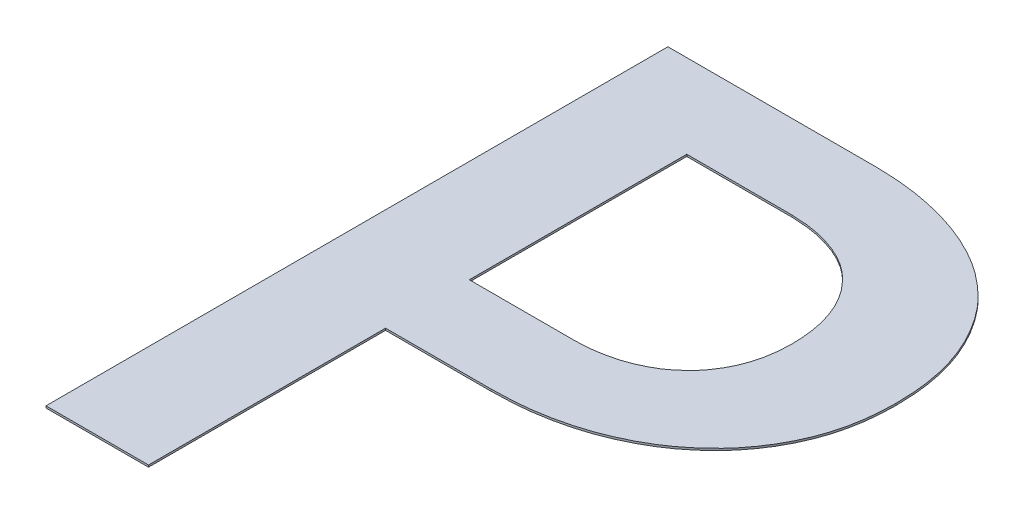
ISO-10303-21;
HEADER;
FILE_DESCRIPTION(('STEP AP214'),'2;1');
FILE_NAME('part.step','',(''),(''),'','','');
FILE_SCHEMA(('AUTOMOTIVE_DESIGN { 1 0 10303 214 1 1 1 1 }'));
ENDSEC;
DATA;
#1=APPLICATION_CONTEXT('core data for automotive mechanical design processes');
#2=APPLICATION_PROTOCOL_DEFINITION('international standard','automotive_design',2000,#1);
#3=PRODUCT_CONTEXT('',#1,'mechanical');
#4=PRODUCT('Part','Part','',(#3));
#5=PRODUCT_RELATED_PRODUCT_CATEGORY('part','',(#4));
#6=PRODUCT_DEFINITION_FORMATION('','',#4);
#7=PRODUCT_DEFINITION_CONTEXT('part definition',#1,'design');
#8=PRODUCT_DEFINITION('design','',#6,#7);
#9=PRODUCT_DEFINITION_SHAPE('','',#8);
#10=(LENGTH_UNIT() NAMED_UNIT(*) SI_UNIT(.MILLI.,.METRE.));
#11=(NAMED_UNIT(*) PLANE_ANGLE_UNIT() SI_UNIT($,.RADIAN.));
#12=(NAMED_UNIT(*) SI_UNIT($,.STERADIAN.) SOLID_ANGLE_UNIT());
#13=UNCERTAINTY_MEASURE_WITH_UNIT(LENGTH_MEASURE(1.E-05),#10,'distance_accuracy_value','');
#14=(GEOMETRIC_REPRESENTATION_CONTEXT(3) GLOBAL_UNCERTAINTY_ASSIGNED_CONTEXT((#13)) GLOBAL_UNIT_ASSIGNED_CONTEXT((#10,
#11,#12)) REPRESENTATION_CONTEXT('',''));
#15=CARTESIAN_POINT('',(0.,0.,0.));
#16=DIRECTION('',(0.,0.,1.));
#17=DIRECTION('',(1.,0.,0.));
#18=AXIS2_PLACEMENT_3D('',#15,#16,#17);
#19=CARTESIAN_POINT('',(-10.95038620204,6.01,2.396145284792));
#20=DIRECTION('',(-1.,0.,0.));
#21=DIRECTION('',(0.,0.,1.));
#22=AXIS2_PLACEMENT_3D('',#19,#20,#21);
#23=PLANE('',#22);
#24=DIRECTION('',(0.,0.,-1.));
#25=VECTOR('',#24,1.);
#26=CARTESIAN_POINT('',(-10.95038620204,6.,2.396145284792));
#27=LINE('',#26,#25);
#28=CARTESIAN_POINT('',(-10.95038620204,6.,2.396145284792));
#29=VERTEX_POINT('',#28);
#30=CARTESIAN_POINT('',(-10.95038620204,6.,1.286122899769));
#31=VERTEX_POINT('',#30);
#32=EDGE_CURVE('E180',#29,#31,#27,.T.);
#33=ORIENTED_EDGE('',*,*,#32,.T.);
#34=DIRECTION('',(0.,-1.,0.));
#35=VECTOR('',#34,1.);
#36=CARTESIAN_POINT('',(-10.95038620204,6.01,1.286122899769));
#37=LINE('',#36,#35);
#38=CARTESIAN_POINT('',(-10.95038620204,6.009999999998,1.286122899769));
#39=VERTEX_POINT('',#38);
#40=EDGE_CURVE('E11',#39,#31,#37,.T.);
#41=ORIENTED_EDGE('',*,*,#40,.F.);
#42=DIRECTION('',(0.,0.,-1.));
#43=VECTOR('',#42,1.);
#44=CARTESIAN_POINT('',(-10.95038620204,6.01,2.396145284792));
#45=LINE('',#44,#43);
#46=CARTESIAN_POINT('',(-10.95038620204,6.01,2.396145284792));
#47=VERTEX_POINT('',#46);
#48=EDGE_CURVE('E202',#47,#39,#45,.T.);
#49=ORIENTED_EDGE('',*,*,#48,.F.);
#50=DIRECTION('',(0.,-1.,0.));
#51=VECTOR('',#50,1.);
#52=CARTESIAN_POINT('',(-10.95038620204,6.01,2.396145284792));
#53=LINE('',#52,#51);
#54=EDGE_CURVE('E182',#47,#29,#53,.T.);
#55=ORIENTED_EDGE('',*,*,#54,.T.);
#56=EDGE_LOOP('',(#33,#41,#49,#55));
#57=FACE_BOUND('',#56,.T.);
#58=ADVANCED_FACE('F16',(#57),#23,.F.);
#59=CARTESIAN_POINT('',(-10.95038620204,6.01,1.286122899769));
#60=DIRECTION('',(0.,0.,-1.));
#61=DIRECTION('',(0.,-1.,0.));
#62=AXIS2_PLACEMENT_3D('',#59,#60,#61);
#63=PLANE('',#62);
#64=DIRECTION('',(1.,0.,0.));
#65=VECTOR('',#64,1.);
#66=CARTESIAN_POINT('',(-10.95038620204,6.,1.286122899769));
#67=LINE('',#66,#65);
#68=CARTESIAN_POINT('',(-10.41217395133,6.,1.286122899769));
#69=VERTEX_POINT('',#68);
#70=EDGE_CURVE('E183',#31,#69,#67,.T.);
#71=ORIENTED_EDGE('',*,*,#70,.T.);
#72=DIRECTION('',(0.,-1.,0.));
#73=VECTOR('',#72,1.);
#74=CARTESIAN_POINT('',(-10.41217395133,6.01,1.286122899769));
#75=LINE('',#74,#73);
#76=CARTESIAN_POINT('',(-10.41217395133,6.01,1.286122899769));
#77=VERTEX_POINT('',#76);
#78=EDGE_CURVE('E30',#77,#69,#75,.T.);
#79=ORIENTED_EDGE('',*,*,#78,.F.);
#80=DIRECTION('',(1.,0.,0.));
#81=VECTOR('',#80,1.);
#82=CARTESIAN_POINT('',(-10.95038620204,6.01,1.286122899769));
#83=LINE('',#82,#81);
#84=EDGE_CURVE('E206',#39,#77,#83,.T.);
#85=ORIENTED_EDGE('',*,*,#84,.F.);
#86=ORIENTED_EDGE('',*,*,#40,.T.);
#87=EDGE_LOOP('',(#71,#79,#85,#86));
#88=FACE_BOUND('',#87,.T.);
#89=ADVANCED_FACE('F457',(#88),#63,.F.);
#90=CARTESIAN_POINT('',(-10.41217395133,6.01,1.286122899769));
#91=CARTESIAN_POINT('',(-10.39061564213,6.01,1.287104789912));
#92=CARTESIAN_POINT('',(-10.34820995169,6.01,1.289036190426));
#93=CARTESIAN_POINT('',(-10.28648622314,6.01,1.29713771831));
#94=CARTESIAN_POINT('',(-10.22822940628,6.01,1.311120204658));
#95=CARTESIAN_POINT('',(-10.17339112048,6.01,1.328908676561));
#96=CARTESIAN_POINT('',(-10.12205805977,6.01,1.35161240023));
#97=CARTESIAN_POINT('',(-10.07472081233,6.01,1.378702792173));
#98=CARTESIAN_POINT('',(-10.03146035385,6.01,1.410518972583));
#99=CARTESIAN_POINT('',(-10.00614197228,6.01,1.435280204639));
#100=CARTESIAN_POINT('',(-9.993492632653,6.01,1.447651186297));
#101=(BOUNDED_CURVE() B_SPLINE_CURVE(3,(#90,#91,#92,#93,#94,#95,#96,#97,#98,#99,#100),
.UNSPECIFIED.,.F.,.F.) B_SPLINE_CURVE_WITH_KNOTS((4,1,1,1,1,1,1,1,4),(0.,0.14052574786,
0.276417380806,0.404689024683,0.530223995438,0.651428726346,0.769566983292,0.88487315103,1.),
.UNSPECIFIED.) CURVE() GEOMETRIC_REPRESENTATION_ITEM() RATIONAL_B_SPLINE_CURVE((1.,1.,1.,1.,1.,
1.,1.,1.,1.,1.,1.)) REPRESENTATION_ITEM(''));
#102=DIRECTION('',(0.,-1.,0.));
#103=VECTOR('',#102,1.);
#104=SURFACE_OF_LINEAR_EXTRUSION('',#101,#103);
#105=CARTESIAN_POINT('',(-10.41217395133,6.,1.286122899769));
#106=CARTESIAN_POINT('',(-10.39061564213,6.,1.287104789912));
#107=CARTESIAN_POINT('',(-10.34820995169,6.,1.289036190426));
#108=CARTESIAN_POINT('',(-10.28648622314,6.,1.29713771831));
#109=CARTESIAN_POINT('',(-10.22822940628,6.,1.311120204658));
#110=CARTESIAN_POINT('',(-10.17339112048,6.,1.328908676561));
#111=CARTESIAN_POINT('',(-10.12205805977,6.,1.35161240023));
#112=CARTESIAN_POINT('',(-10.07472081233,6.,1.378702792173));
#113=CARTESIAN_POINT('',(-10.03146035385,6.,1.410518972583));
#114=CARTESIAN_POINT('',(-10.00614197228,6.,1.435280204639));
#115=CARTESIAN_POINT('',(-9.993492632653,6.,1.447651186297));
#116=B_SPLINE_CURVE_WITH_KNOTS('',3,(#105,#106,#107,#108,#109,#110,#111,#112,#113,#114,#115),
.UNSPECIFIED.,.F.,.F.,(4,1,1,1,1,1,1,1,4),(0.,0.14052574786,0.276417380806,0.404689024683,
0.530223995438,0.651428726346,0.769566983292,0.88487315103,1.),.UNSPECIFIED.);
#117=CARTESIAN_POINT('',(-9.993492632653,6.,1.447651186297));
#118=VERTEX_POINT('',#117);
#119=EDGE_CURVE('E192',#69,#118,#116,.T.);
#120=ORIENTED_EDGE('',*,*,#119,.T.);
#121=DIRECTION('',(0.,-1.,0.));
#122=VECTOR('',#121,1.);
#123=CARTESIAN_POINT('',(-9.993492632653,6.01,1.447651186297));
#124=LINE('',#123,#122);
#125=CARTESIAN_POINT('',(-9.993492632653,6.01,1.447651186297));
#126=VERTEX_POINT('',#125);
#127=EDGE_CURVE('E196',#126,#118,#124,.T.);
#128=ORIENTED_EDGE('',*,*,#127,.F.);
#129=CARTESIAN_POINT('',(-10.41217395133,6.01,1.286122899769));
#130=CARTESIAN_POINT('',(-10.39061564213,6.01,1.287104789912));
#131=CARTESIAN_POINT('',(-10.34820995169,6.01,1.289036190426));
#132=CARTESIAN_POINT('',(-10.28648622314,6.01,1.29713771831));
#133=CARTESIAN_POINT('',(-10.22822940628,6.01,1.311120204658));
#134=CARTESIAN_POINT('',(-10.17339112048,6.01,1.328908676561));
#135=CARTESIAN_POINT('',(-10.12205805977,6.01,1.35161240023));
#136=CARTESIAN_POINT('',(-10.07472081233,6.01,1.378702792173));
#137=CARTESIAN_POINT('',(-10.03146035385,6.01,1.410518972583));
#138=CARTESIAN_POINT('',(-10.00614197228,6.01,1.435280204639));
#139=CARTESIAN_POINT('',(-9.993492632653,6.01,1.447651186297));
#140=B_SPLINE_CURVE_WITH_KNOTS('',3,(#129,#130,#131,#132,#133,#134,#135,#136,#137,#138,#139),
.UNSPECIFIED.,.F.,.F.,(4,1,1,1,1,1,1,1,4),(0.,0.14052574786,0.276417380806,0.404689024683,
0.530223995438,0.651428726346,0.769566983292,0.88487315103,1.),.UNSPECIFIED.);
#141=EDGE_CURVE('E211',#77,#126,#140,.T.);
#142=ORIENTED_EDGE('',*,*,#141,.F.);
#143=ORIENTED_EDGE('',*,*,#78,.T.);
#144=EDGE_LOOP('',(#120,#128,#142,#143));
#145=FACE_BOUND('',#144,.T.);
#146=ADVANCED_FACE('F456',(#145),#104,.F.);
#147=CARTESIAN_POINT('',(-9.993492632653,6.01,1.447651186297));
#148=CARTESIAN_POINT('',(-9.981556535716,6.01,1.460754279016));
#149=CARTESIAN_POINT('',(-9.957739204466,6.01,1.486900237893));
#150=CARTESIAN_POINT('',(-9.927455859616,6.01,1.530656389083));
#151=CARTESIAN_POINT('',(-9.90123124537,6.01,1.577514720148));
#152=CARTESIAN_POINT('',(-9.880262873755,6.01,1.627924850447));
#153=CARTESIAN_POINT('',(-9.86305676779,6.01,1.681211322786));
#154=CARTESIAN_POINT('',(-9.851852823006,6.01,1.737600650919));
#155=CARTESIAN_POINT('',(-9.844455119814,6.01,1.796787745854));
#156=CARTESIAN_POINT('',(-9.843458376492,6.01,1.837233808429));
#157=CARTESIAN_POINT('',(-9.842948269608,6.01,1.857933034079));
#158=(BOUNDED_CURVE() B_SPLINE_CURVE(3,(#147,#148,#149,#150,#151,#152,#153,#154,#155,#156,#157),
.UNSPECIFIED.,.F.,.F.) B_SPLINE_CURVE_WITH_KNOTS((4,1,1,1,1,1,1,1,4),(0.,0.118517492591,
0.236490235872,0.355217928142,0.477302145162,0.601303082104,0.729367994928,0.861497693858,1.),
.UNSPECIFIED.) CURVE() GEOMETRIC_REPRESENTATION_ITEM() RATIONAL_B_SPLINE_CURVE((1.,1.,1.,1.,1.,
1.,1.,1.,1.,1.,1.)) REPRESENTATION_ITEM(''));
#159=DIRECTION('',(0.,-1.,0.));
#160=VECTOR('',#159,1.);
#161=SURFACE_OF_LINEAR_EXTRUSION('',#158,#160);
#162=CARTESIAN_POINT('',(-9.993492632653,6.,1.447651186297));
#163=CARTESIAN_POINT('',(-9.981556535716,6.,1.460754279016));
#164=CARTESIAN_POINT('',(-9.957739204466,6.,1.486900237893));
#165=CARTESIAN_POINT('',(-9.927455859616,6.,1.530656389083));
#166=CARTESIAN_POINT('',(-9.90123124537,6.,1.577514720148));
#167=CARTESIAN_POINT('',(-9.880262873755,6.,1.627924850447));
#168=CARTESIAN_POINT('',(-9.86305676779,6.,1.681211322786));
#169=CARTESIAN_POINT('',(-9.851852823006,6.,1.737600650919));
#170=CARTESIAN_POINT('',(-9.844455119814,6.,1.796787745854));
#171=CARTESIAN_POINT('',(-9.843458376492,6.,1.837233808429));
#172=CARTESIAN_POINT('',(-9.842948269608,6.,1.857933034079));
#173=B_SPLINE_CURVE_WITH_KNOTS('',3,(#162,#163,#164,#165,#166,#167,#168,#169,#170,#171,#172),
.UNSPECIFIED.,.F.,.F.,(4,1,1,1,1,1,1,1,4),(0.,0.118517492591,0.236490235872,0.355217928142,
0.477302145162,0.601303082104,0.729367994928,0.861497693858,1.),.UNSPECIFIED.);
#174=CARTESIAN_POINT('',(-9.842948269608,6.,1.857933034079));
#175=VERTEX_POINT('',#174);
#176=EDGE_CURVE('E285',#118,#175,#173,.T.);
#177=ORIENTED_EDGE('',*,*,#176,.T.);
#178=DIRECTION('',(0.,-1.,0.));
#179=VECTOR('',#178,1.);
#180=CARTESIAN_POINT('',(-9.842948269608,6.01,1.857933034079));
#181=LINE('',#180,#179);
#182=CARTESIAN_POINT('',(-9.842948269608,6.01,1.857933034079));
#183=VERTEX_POINT('',#182);
#184=EDGE_CURVE('E193',#183,#175,#181,.T.);
#185=ORIENTED_EDGE('',*,*,#184,.F.);
#186=CARTESIAN_POINT('',(-9.993492632653,6.01,1.447651186297));
#187=CARTESIAN_POINT('',(-9.981556535716,6.01,1.460754279016));
#188=CARTESIAN_POINT('',(-9.957739204466,6.01,1.486900237893));
#189=CARTESIAN_POINT('',(-9.927455859616,6.01,1.530656389083));
#190=CARTESIAN_POINT('',(-9.90123124537,6.01,1.577514720148));
#191=CARTESIAN_POINT('',(-9.880262873755,6.01,1.627924850447));
#192=CARTESIAN_POINT('',(-9.86305676779,6.01,1.681211322786));
#193=CARTESIAN_POINT('',(-9.851852823006,6.01,1.737600650919));
#194=CARTESIAN_POINT('',(-9.844455119814,6.01,1.796787745854));
#195=CARTESIAN_POINT('',(-9.843458376492,6.01,1.837233808429));
#196=CARTESIAN_POINT('',(-9.842948269608,6.01,1.857933034079));
#197=B_SPLINE_CURVE_WITH_KNOTS('',3,(#186,#187,#188,#189,#190,#191,#192,#193,#194,#195,#196),
.UNSPECIFIED.,.F.,.F.,(4,1,1,1,1,1,1,1,4),(0.,0.118517492591,0.236490235872,0.355217928142,
0.477302145162,0.601303082104,0.729367994928,0.861497693858,1.),.UNSPECIFIED.);
#198=EDGE_CURVE('E319',#126,#183,#197,.T.);
#199=ORIENTED_EDGE('',*,*,#198,.F.);
#200=ORIENTED_EDGE('',*,*,#127,.T.);
#201=EDGE_LOOP('',(#177,#185,#199,#200));
#202=FACE_BOUND('',#201,.T.);
#203=ADVANCED_FACE('F451',(#202),#161,.F.);
#204=CARTESIAN_POINT('',(-9.842948269608,6.01,1.857933034079));
#205=CARTESIAN_POINT('',(-9.843464652479,6.01,1.876910310168));
#206=CARTESIAN_POINT('',(-9.844477641894,6.01,1.914138074545));
#207=CARTESIAN_POINT('',(-9.851874196864,6.01,1.968820429887));
#208=CARTESIAN_POINT('',(-9.863278486037,6.01,2.021498983627));
#209=CARTESIAN_POINT('',(-9.880105266203,6.01,2.071683533863));
#210=CARTESIAN_POINT('',(-9.901397061999,6.01,2.119190306131));
#211=CARTESIAN_POINT('',(-9.92767311889,6.01,2.163379305529));
#212=CARTESIAN_POINT('',(-9.957590282255,6.01,2.205075645955));
#213=CARTESIAN_POINT('',(-9.981533109567,6.01,2.229516135712));
#214=CARTESIAN_POINT('',(-9.993492632653,6.01,2.241724242871));
#215=(BOUNDED_CURVE() B_SPLINE_CURVE(3,(#204,#205,#206,#207,#208,#209,#210,#211,#212,#213,#214),
.UNSPECIFIED.,.F.,.F.) B_SPLINE_CURVE_WITH_KNOTS((4,1,1,1,1,1,1,1,4),(0.,0.134354815369,
0.263564137766,0.390117692403,0.515517169,0.63770338976,0.758028749237,0.879134543217,1.),
.UNSPECIFIED.) CURVE() GEOMETRIC_REPRESENTATION_ITEM() RATIONAL_B_SPLINE_CURVE((1.,1.,1.,1.,1.,
1.,1.,1.,1.,1.,1.)) REPRESENTATION_ITEM(''));
#216=DIRECTION('',(0.,-1.,0.));
#217=VECTOR('',#216,1.);
#218=SURFACE_OF_LINEAR_EXTRUSION('',#215,#217);
#219=CARTESIAN_POINT('',(-9.842948269608,6.,1.857933034079));
#220=CARTESIAN_POINT('',(-9.843464652479,6.,1.876910310168));
#221=CARTESIAN_POINT('',(-9.844477641894,6.,1.914138074545));
#222=CARTESIAN_POINT('',(-9.851874196864,6.,1.968820429887));
#223=CARTESIAN_POINT('',(-9.863278486037,6.,2.021498983627));
#224=CARTESIAN_POINT('',(-9.880105266203,6.,2.071683533863));
#225=CARTESIAN_POINT('',(-9.901397061999,6.,2.119190306131));
#226=CARTESIAN_POINT('',(-9.92767311889,6.,2.163379305529));
#227=CARTESIAN_POINT('',(-9.957590282255,6.,2.205075645955));
#228=CARTESIAN_POINT('',(-9.981533109567,6.,2.229516135712));
#229=CARTESIAN_POINT('',(-9.993492632653,6.,2.241724242871));
#230=B_SPLINE_CURVE_WITH_KNOTS('',3,(#219,#220,#221,#222,#223,#224,#225,#226,#227,#228,#229),
.UNSPECIFIED.,.F.,.F.,(4,1,1,1,1,1,1,1,4),(0.,0.134354815369,0.263564137766,0.390117692403,
0.515517169,0.63770338976,0.758028749237,0.879134543217,1.),.UNSPECIFIED.);
#231=CARTESIAN_POINT('',(-9.993492632653,6.,2.241724242871));
#232=VERTEX_POINT('',#231);
#233=EDGE_CURVE('E294',#175,#232,#230,.T.);
#234=ORIENTED_EDGE('',*,*,#233,.T.);
#235=DIRECTION('',(0.,-1.,0.));
#236=VECTOR('',#235,1.);
#237=CARTESIAN_POINT('',(-9.993492632653,6.01,2.241724242871));
#238=LINE('',#237,#236);
#239=CARTESIAN_POINT('',(-9.993492632653,6.01,2.241724242871));
#240=VERTEX_POINT('',#239);
#241=EDGE_CURVE('E197',#240,#232,#238,.T.);
#242=ORIENTED_EDGE('',*,*,#241,.F.);
#243=CARTESIAN_POINT('',(-9.842948269608,6.01,1.857933034079));
#244=CARTESIAN_POINT('',(-9.843464652479,6.01,1.876910310168));
#245=CARTESIAN_POINT('',(-9.844477641894,6.01,1.914138074545));
#246=CARTESIAN_POINT('',(-9.851874196864,6.01,1.968820429887));
#247=CARTESIAN_POINT('',(-9.863278486037,6.01,2.021498983627));
#248=CARTESIAN_POINT('',(-9.880105266203,6.01,2.071683533863));
#249=CARTESIAN_POINT('',(-9.901397061999,6.01,2.119190306131));
#250=CARTESIAN_POINT('',(-9.92767311889,6.01,2.163379305529));
#251=CARTESIAN_POINT('',(-9.957590282255,6.01,2.205075645955));
#252=CARTESIAN_POINT('',(-9.981533109567,6.01,2.229516135712));
#253=CARTESIAN_POINT('',(-9.993492632653,6.01,2.241724242871));
#254=B_SPLINE_CURVE_WITH_KNOTS('',3,(#243,#244,#245,#246,#247,#248,#249,#250,#251,#252,#253),
.UNSPECIFIED.,.F.,.F.,(4,1,1,1,1,1,1,1,4),(0.,0.134354815369,0.263564137766,0.390117692403,
0.515517169,0.63770338976,0.758028749237,0.879134543217,1.),.UNSPECIFIED.);
#255=EDGE_CURVE('E272',#183,#240,#254,.T.);
#256=ORIENTED_EDGE('',*,*,#255,.F.);
#257=ORIENTED_EDGE('',*,*,#184,.T.);
#258=EDGE_LOOP('',(#234,#242,#256,#257));
#259=FACE_BOUND('',#258,.T.);
#260=ADVANCED_FACE('F447',(#259),#218,.F.);
#261=CARTESIAN_POINT('',(-9.993492632653,6.01,2.241724242871));
#262=CARTESIAN_POINT('',(-10.00621375128,6.01,2.253160462077));
#263=CARTESIAN_POINT('',(-10.03191665949,6.01,2.276267242317));
#264=CARTESIAN_POINT('',(-10.07469808081,6.01,2.3069564853));
#265=CARTESIAN_POINT('',(-10.1224348403,6.01,2.332331882933));
#266=CARTESIAN_POINT('',(-10.17322827444,6.01,2.355507517809));
#267=CARTESIAN_POINT('',(-10.22828076931,6.01,2.372427606159));
#268=CARTESIAN_POINT('',(-10.28656708435,6.01,2.38557406771));
#269=CARTESIAN_POINT('',(-10.34818087792,6.01,2.39408812186));
#270=CARTESIAN_POINT('',(-10.39060969803,6.01,2.395452066289));
#271=CARTESIAN_POINT('',(-10.41217395133,6.01,2.396145284792));
#272=(BOUNDED_CURVE() B_SPLINE_CURVE(3,(#261,#262,#263,#264,#265,#266,#267,#268,#269,#270,#271),
.UNSPECIFIED.,.F.,.F.) B_SPLINE_CURVE_WITH_KNOTS((4,1,1,1,1,1,1,1,4),(0.,0.112226925341,
0.22675351478,0.344412268321,0.466545248744,0.592606541323,0.721543292644,0.858475655118,1.),
.UNSPECIFIED.) CURVE() GEOMETRIC_REPRESENTATION_ITEM() RATIONAL_B_SPLINE_CURVE((1.,1.,1.,1.,1.,
1.,1.,1.,1.,1.,1.)) REPRESENTATION_ITEM(''));
#273=DIRECTION('',(0.,-1.,0.));
#274=VECTOR('',#273,1.);
#275=SURFACE_OF_LINEAR_EXTRUSION('',#272,#274);
#276=CARTESIAN_POINT('',(-9.993492632653,6.,2.241724242871));
#277=CARTESIAN_POINT('',(-10.00621375128,6.,2.253160462077));
#278=CARTESIAN_POINT('',(-10.03191665949,6.,2.276267242317));
#279=CARTESIAN_POINT('',(-10.07469808081,6.,2.3069564853));
#280=CARTESIAN_POINT('',(-10.1224348403,6.,2.332331882933));
#281=CARTESIAN_POINT('',(-10.17322827444,6.,2.355507517809));
#282=CARTESIAN_POINT('',(-10.22828076931,6.,2.372427606159));
#283=CARTESIAN_POINT('',(-10.28656708435,6.,2.38557406771));
#284=CARTESIAN_POINT('',(-10.34818087792,6.,2.39408812186));
#285=CARTESIAN_POINT('',(-10.39060969803,6.,2.395452066289));
#286=CARTESIAN_POINT('',(-10.41217395133,6.,2.396145284792));
#287=B_SPLINE_CURVE_WITH_KNOTS('',3,(#276,#277,#278,#279,#280,#281,#282,#283,#284,#285,#286),
.UNSPECIFIED.,.F.,.F.,(4,1,1,1,1,1,1,1,4),(0.,0.112226925341,0.22675351478,0.344412268321,
0.466545248744,0.592606541323,0.721543292644,0.858475655118,1.),.UNSPECIFIED.);
#288=CARTESIAN_POINT('',(-10.41217395133,6.,2.396145284792));
#289=VERTEX_POINT('',#288);
#290=EDGE_CURVE('E271',#232,#289,#287,.T.);
#291=ORIENTED_EDGE('',*,*,#290,.T.);
#292=DIRECTION('',(0.,-1.,0.));
#293=VECTOR('',#292,1.);
#294=CARTESIAN_POINT('',(-10.41217395133,6.01,2.396145284792));
#295=LINE('',#294,#293);
#296=CARTESIAN_POINT('',(-10.41217395133,6.01,2.396145284792));
#297=VERTEX_POINT('',#296);
#298=EDGE_CURVE('E243',#297,#289,#295,.T.);
#299=ORIENTED_EDGE('',*,*,#298,.F.);
#300=CARTESIAN_POINT('',(-9.993492632653,6.01,2.241724242871));
#301=CARTESIAN_POINT('',(-10.00621375128,6.01,2.253160462077));
#302=CARTESIAN_POINT('',(-10.03191665949,6.01,2.276267242317));
#303=CARTESIAN_POINT('',(-10.07469808081,6.01,2.3069564853));
#304=CARTESIAN_POINT('',(-10.1224348403,6.01,2.332331882933));
#305=CARTESIAN_POINT('',(-10.17322827444,6.01,2.355507517809));
#306=CARTESIAN_POINT('',(-10.22828076931,6.01,2.372427606159));
#307=CARTESIAN_POINT('',(-10.28656708435,6.01,2.38557406771));
#308=CARTESIAN_POINT('',(-10.34818087792,6.01,2.39408812186));
#309=CARTESIAN_POINT('',(-10.39060969803,6.01,2.395452066289));
#310=CARTESIAN_POINT('',(-10.41217395133,6.01,2.396145284792));
#311=B_SPLINE_CURVE_WITH_KNOTS('',3,(#300,#301,#302,#303,#304,#305,#306,#307,#308,#309,#310),
.UNSPECIFIED.,.F.,.F.,(4,1,1,1,1,1,1,1,4),(0.,0.112226925341,0.22675351478,0.344412268321,
0.466545248744,0.592606541323,0.721543292644,0.858475655118,1.),.UNSPECIFIED.);
#312=EDGE_CURVE('E226',#240,#297,#311,.T.);
#313=ORIENTED_EDGE('',*,*,#312,.F.);
#314=ORIENTED_EDGE('',*,*,#241,.T.);
#315=EDGE_LOOP('',(#291,#299,#313,#314));
#316=FACE_BOUND('',#315,.T.);
#317=ADVANCED_FACE('F443',(#316),#275,.F.);
#318=CARTESIAN_POINT('',(-10.41217395133,6.01,2.396145284792));
#319=DIRECTION('',(0.,0.,1.));
#320=DIRECTION('',(1.,0.,0.));
#321=AXIS2_PLACEMENT_3D('',#318,#319,#320);
#322=PLANE('',#321);
#323=DIRECTION('',(-1.,0.,0.));
#324=VECTOR('',#323,1.);
#325=CARTESIAN_POINT('',(-10.41217395133,6.,2.396145284792));
#326=LINE('',#325,#324);
#327=EDGE_CURVE('E267',#289,#29,#326,.T.);
#328=ORIENTED_EDGE('',*,*,#327,.T.);
#329=ORIENTED_EDGE('',*,*,#54,.F.);
#330=DIRECTION('',(-1.,0.,0.));
#331=VECTOR('',#330,1.);
#332=CARTESIAN_POINT('',(-10.41217395133,6.01,2.396145284792));
#333=LINE('',#332,#331);
#334=EDGE_CURVE('E207',#297,#47,#333,.T.);
#335=ORIENTED_EDGE('',*,*,#334,.F.);
#336=ORIENTED_EDGE('',*,*,#298,.T.);
#337=EDGE_LOOP('',(#328,#329,#335,#336));
#338=FACE_BOUND('',#337,.T.);
#339=ADVANCED_FACE('F440',(#338),#322,.F.);
#340=CARTESIAN_POINT('',(-9.992396536457,6.,2.761462864758));
#341=DIRECTION('',(0.,-1.,1.150556770738E-12));
#342=DIRECTION('',(-1.,0.,0.));
#343=AXIS2_PLACEMENT_3D('',#340,#341,#342);
#344=PLANE('',#343);
#345=DIRECTION('',(0.,0.,-1.));
#346=VECTOR('',#345,1.);
#347=CARTESIAN_POINT('',(-10.95038620204,6.,4.034042110188));
#348=LINE('',#347,#346);
#349=CARTESIAN_POINT('',(-10.95038620204,6.,4.034042110188));
#350=VERTEX_POINT('',#349);
#351=CARTESIAN_POINT('',(-10.95038620204,6.,2.823872187518));
#352=VERTEX_POINT('',#351);
#353=EDGE_CURVE('E227',#350,#352,#348,.T.);
#354=ORIENTED_EDGE('',*,*,#353,.F.);
#355=DIRECTION('',(1.,0.,0.));
#356=VECTOR('',#355,1.);
#357=CARTESIAN_POINT('',(-11.47373785039,6.,4.034042110188));
#358=LINE('',#357,#356);
#359=CARTESIAN_POINT('',(-11.47373785039,6.,4.034042110188));
#360=VERTEX_POINT('',#359);
#361=EDGE_CURVE('E255',#360,#350,#358,.T.);
#362=ORIENTED_EDGE('',*,*,#361,.F.);
#363=DIRECTION('',(0.,0.,1.));
#364=VECTOR('',#363,1.);
#365=CARTESIAN_POINT('',(-11.47373785039,6.,0.859042110188));
#366=LINE('',#365,#364);
#367=CARTESIAN_POINT('',(-11.47373785039,6.,0.859042110188));
#368=VERTEX_POINT('',#367);
#369=EDGE_CURVE('E152',#368,#360,#366,.T.);
#370=ORIENTED_EDGE('',*,*,#369,.F.);
#371=DIRECTION('',(-1.,0.,0.));
#372=VECTOR('',#371,1.);
#373=CARTESIAN_POINT('',(-10.41217395133,6.,0.859042110188));
#374=LINE('',#373,#372);
#375=CARTESIAN_POINT('',(-10.41217395133,6.,0.859042110188));
#376=VERTEX_POINT('',#375);
#377=EDGE_CURVE('E166',#376,#368,#374,.T.);
#378=ORIENTED_EDGE('',*,*,#377,.F.);
#379=CARTESIAN_POINT('',(-9.622623686784,6.,1.129117405264));
#380=CARTESIAN_POINT('',(-9.647594592545,6.,1.10827741317));
#381=CARTESIAN_POINT('',(-9.697866112228,6.,1.066322264136));
#382=CARTESIAN_POINT('',(-9.782288001918,6.,1.013658851304));
#383=CARTESIAN_POINT('',(-9.873100108047,6.,0.967632930551));
#384=CARTESIAN_POINT('',(-9.970548300151,6.,0.928810187814));
#385=CARTESIAN_POINT('',(-10.07410767756,6.,0.898927659984));
#386=CARTESIAN_POINT('',(-10.18241654326,6.,0.875914684539));
#387=CARTESIAN_POINT('',(-10.29575102663,6.,0.862376103784));
#388=CARTESIAN_POINT('',(-10.37294132326,6.,0.86016561169));
#389=CARTESIAN_POINT('',(-10.41217395133,6.,0.859042110188));
#390=B_SPLINE_CURVE_WITH_KNOTS('',3,(#379,#380,#381,#382,#383,#384,#385,#386,#387,#388,#389),
.UNSPECIFIED.,.F.,.F.,(4,1,1,1,1,1,1,1,4),(0.,0.114377825174,0.230265859971,0.349276247655,
0.47246353563,0.598893027252,0.728255004333,0.86188328314,1.),.UNSPECIFIED.);
#391=CARTESIAN_POINT('',(-9.622623686784,6.,1.129117405264));
#392=VERTEX_POINT('',#391);
#393=EDGE_CURVE('E169',#392,#376,#390,.T.);
#394=ORIENTED_EDGE('',*,*,#393,.F.);
#395=CARTESIAN_POINT('',(-9.315073829234,6.,1.853410242057));
#396=CARTESIAN_POINT('',(-9.316063334944,6.,1.816099239356));
#397=CARTESIAN_POINT('',(-9.317993380004,6.,1.743323594185));
#398=CARTESIAN_POINT('',(-9.333168978138,6.,1.636985022001));
#399=CARTESIAN_POINT('',(-9.358109411667,6.,1.536348203298));
#400=CARTESIAN_POINT('',(-9.39403763413,6.,1.44165614319));
#401=CARTESIAN_POINT('',(-9.438534400139,6.,1.353128689395));
#402=CARTESIAN_POINT('',(-9.491336556029,6.,1.271054771559));
#403=CARTESIAN_POINT('',(-9.551883550485,6.,1.195248116225));
#404=CARTESIAN_POINT('',(-9.599011707294,6.,1.151190828819));
#405=CARTESIAN_POINT('',(-9.622623686784,6.,1.129117405264));
#406=B_SPLINE_CURVE_WITH_KNOTS('',3,(#395,#396,#397,#398,#399,#400,#401,#402,#403,#404,#405),
.UNSPECIFIED.,.F.,.F.,(4,1,1,1,1,1,1,1,4),(0.,0.137880567732,0.268938022214,0.396187076438,
0.520398722577,0.642523580873,0.761778280589,0.880647011602,1.),.UNSPECIFIED.);
#407=CARTESIAN_POINT('',(-9.315073829234,6.,1.853410242057));
#408=VERTEX_POINT('',#407);
#409=EDGE_CURVE('E259',#408,#392,#406,.T.);
#410=ORIENTED_EDGE('',*,*,#409,.F.);
#411=CARTESIAN_POINT('',(-9.622623686784,6.,2.555735231882));
#412=CARTESIAN_POINT('',(-9.59903722197,6.,2.534079080695));
#413=CARTESIAN_POINT('',(-9.552107743613,6.,2.490990305568));
#414=CARTESIAN_POINT('',(-9.491544618818,6.,2.417186670696));
#415=CARTESIAN_POINT('',(-9.438537605578,6.,2.337620175189));
#416=CARTESIAN_POINT('',(-9.394047709104,6.,2.25164969702));
#417=CARTESIAN_POINT('',(-9.358230133345,6.,2.159719527296));
#418=CARTESIAN_POINT('',(-9.333146669018,6.,2.062123071335));
#419=CARTESIAN_POINT('',(-9.318057172316,6.,1.95941407185));
#420=CARTESIAN_POINT('',(-9.31608146895,6.,1.889213589522));
#421=CARTESIAN_POINT('',(-9.315073829234,6.,1.853410242057));
#422=B_SPLINE_CURVE_WITH_KNOTS('',3,(#411,#412,#413,#414,#415,#416,#417,#418,#419,#420,#421),
.UNSPECIFIED.,.F.,.F.,(4,1,1,1,1,1,1,1,4),(0.,0.121249746887,0.241247996131,0.360801084557,
0.483123471511,0.607442836968,0.733972781045,0.864321944241,1.),.UNSPECIFIED.);
#423=CARTESIAN_POINT('',(-9.622623686784,6.,2.555735231882));
#424=VERTEX_POINT('',#423);
#425=EDGE_CURVE('E237',#424,#408,#422,.T.);
#426=ORIENTED_EDGE('',*,*,#425,.F.);
#427=CARTESIAN_POINT('',(-10.41217395133,6.,2.823872187518));
#428=CARTESIAN_POINT('',(-10.3729435425,6.,2.822967227611));
#429=CARTESIAN_POINT('',(-10.29577409215,6.,2.82118709682));
#430=CARTESIAN_POINT('',(-10.18245938669,6.,2.808236928736));
#431=CARTESIAN_POINT('',(-10.07402624774,6.,2.786088219203));
#432=CARTESIAN_POINT('',(-9.970558504019,6.,2.755997173899));
#433=CARTESIAN_POINT('',(-9.873097504457,6.,2.717231258948));
#434=CARTESIAN_POINT('',(-9.782288666327,6.,2.671190837804));
#435=CARTESIAN_POINT('',(-9.697865950467,6.,2.618531090755));
#436=CARTESIAN_POINT('',(-9.647594538861,6.,2.576575462176));
#437=CARTESIAN_POINT('',(-9.622623686784,6.,2.555735231882));
#438=B_SPLINE_CURVE_WITH_KNOTS('',3,(#427,#428,#429,#430,#431,#432,#433,#434,#435,#436,#437),
.UNSPECIFIED.,.F.,.F.,(4,1,1,1,1,1,1,1,4),(0.,0.138123182207,0.2716996934,0.400943544866,
0.52740753698,0.650628440703,0.76967130433,0.885590963032,1.),.UNSPECIFIED.);
#439=CARTESIAN_POINT('',(-10.41217395133,6.,2.823872187518));
#440=VERTEX_POINT('',#439);
#441=EDGE_CURVE('E21',#440,#424,#438,.T.);
#442=ORIENTED_EDGE('',*,*,#441,.F.);
#443=DIRECTION('',(1.,0.,0.));
#444=VECTOR('',#443,1.);
#445=CARTESIAN_POINT('',(-10.95038620204,6.,2.823872187518));
#446=LINE('',#445,#444);
#447=EDGE_CURVE('E184',#352,#440,#446,.T.);
#448=ORIENTED_EDGE('',*,*,#447,.F.);
#449=EDGE_LOOP('',(#354,#362,#370,#378,#394,#410,#426,#442,#448));
#450=FACE_BOUND('',#449,.T.);
#451=ORIENTED_EDGE('',*,*,#327,.F.);
#452=ORIENTED_EDGE('',*,*,#290,.F.);
#453=ORIENTED_EDGE('',*,*,#233,.F.);
#454=ORIENTED_EDGE('',*,*,#176,.F.);
#455=ORIENTED_EDGE('',*,*,#119,.F.);
#456=ORIENTED_EDGE('',*,*,#70,.F.);
#457=ORIENTED_EDGE('',*,*,#32,.F.);
#458=EDGE_LOOP('',(#451,#452,#453,#454,#455,#456,#457));
#459=FACE_BOUND('',#458,.T.);
#460=ADVANCED_FACE('F437',(#450,#459),#344,.T.);
#461=CARTESIAN_POINT('',(-9.992396536457,6.01,2.761462864758));
#462=DIRECTION('',(0.,-1.,1.150556770738E-12));
#463=DIRECTION('',(-1.,0.,0.));
#464=AXIS2_PLACEMENT_3D('',#461,#462,#463);
#465=PLANE('',#464);
#466=DIRECTION('',(0.,0.,-1.));
#467=VECTOR('',#466,1.);
#468=CARTESIAN_POINT('',(-10.95038620204,6.01,4.034042110188));
#469=LINE('',#468,#467);
#470=CARTESIAN_POINT('',(-10.95038620204,6.01,4.034042110188));
#471=VERTEX_POINT('',#470);
#472=CARTESIAN_POINT('',(-10.95038620204,6.01,2.823872187518));
#473=VERTEX_POINT('',#472);
#474=EDGE_CURVE('E215',#471,#473,#469,.T.);
#475=ORIENTED_EDGE('',*,*,#474,.T.);
#476=DIRECTION('',(1.,0.,0.));
#477=VECTOR('',#476,1.);
#478=CARTESIAN_POINT('',(-10.95038620204,6.01,2.823872187518));
#479=LINE('',#478,#477);
#480=CARTESIAN_POINT('',(-10.41217395133,6.01,2.823872187518));
#481=VERTEX_POINT('',#480);
#482=EDGE_CURVE('E201',#473,#481,#479,.T.);
#483=ORIENTED_EDGE('',*,*,#482,.T.);
#484=CARTESIAN_POINT('',(-10.41217395133,6.01,2.823872187518));
#485=CARTESIAN_POINT('',(-10.3729435425,6.01,2.822967227611));
#486=CARTESIAN_POINT('',(-10.29577409215,6.01,2.82118709682));
#487=CARTESIAN_POINT('',(-10.18245938669,6.01,2.808236928736));
#488=CARTESIAN_POINT('',(-10.07402624774,6.01,2.786088219203));
#489=CARTESIAN_POINT('',(-9.970558504019,6.01,2.755997173899));
#490=CARTESIAN_POINT('',(-9.873097504457,6.01,2.717231258948));
#491=CARTESIAN_POINT('',(-9.782288666327,6.01,2.671190837804));
#492=CARTESIAN_POINT('',(-9.697865950467,6.01,2.618531090755));
#493=CARTESIAN_POINT('',(-9.647594538861,6.01,2.576575462176));
#494=CARTESIAN_POINT('',(-9.622623686784,6.01,2.555735231882));
#495=B_SPLINE_CURVE_WITH_KNOTS('',3,(#484,#485,#486,#487,#488,#489,#490,#491,#492,#493,#494),
.UNSPECIFIED.,.F.,.F.,(4,1,1,1,1,1,1,1,4),(0.,0.138123182207,0.2716996934,0.400943544866,
0.52740753698,0.650628440703,0.76967130433,0.885590963032,1.),.UNSPECIFIED.);
#496=CARTESIAN_POINT('',(-9.622623686784,6.01,2.555735231882));
#497=VERTEX_POINT('',#496);
#498=EDGE_CURVE('E242',#481,#497,#495,.T.);
#499=ORIENTED_EDGE('',*,*,#498,.T.);
#500=CARTESIAN_POINT('',(-9.622623686784,6.01,2.555735231882));
#501=CARTESIAN_POINT('',(-9.59903722197,6.01,2.534079080695));
#502=CARTESIAN_POINT('',(-9.552107743613,6.01,2.490990305568));
#503=CARTESIAN_POINT('',(-9.491544618818,6.01,2.417186670696));
#504=CARTESIAN_POINT('',(-9.438537605578,6.01,2.337620175189));
#505=CARTESIAN_POINT('',(-9.394047709104,6.01,2.25164969702));
#506=CARTESIAN_POINT('',(-9.358230133345,6.01,2.159719527296));
#507=CARTESIAN_POINT('',(-9.333146669018,6.01,2.062123071335));
#508=CARTESIAN_POINT('',(-9.318057172316,6.01,1.95941407185));
#509=CARTESIAN_POINT('',(-9.31608146895,6.01,1.889213589522));
#510=CARTESIAN_POINT('',(-9.315073829234,6.01,1.853410242057));
#511=B_SPLINE_CURVE_WITH_KNOTS('',3,(#500,#501,#502,#503,#504,#505,#506,#507,#508,#509,#510),
.UNSPECIFIED.,.F.,.F.,(4,1,1,1,1,1,1,1,4),(0.,0.121249746887,0.241247996131,0.360801084557,
0.483123471511,0.607442836968,0.733972781045,0.864321944241,1.),.UNSPECIFIED.);
#512=CARTESIAN_POINT('',(-9.315073829234,6.01,1.853410242057));
#513=VERTEX_POINT('',#512);
#514=EDGE_CURVE('E236',#497,#513,#511,.T.);
#515=ORIENTED_EDGE('',*,*,#514,.T.);
#516=CARTESIAN_POINT('',(-9.315073829234,6.01,1.853410242057));
#517=CARTESIAN_POINT('',(-9.316063334944,6.01,1.816099239356));
#518=CARTESIAN_POINT('',(-9.317993380004,6.01,1.743323594185));
#519=CARTESIAN_POINT('',(-9.333168978138,6.01,1.636985022001));
#520=CARTESIAN_POINT('',(-9.358109411667,6.01,1.536348203298));
#521=CARTESIAN_POINT('',(-9.39403763413,6.01,1.44165614319));
#522=CARTESIAN_POINT('',(-9.438534400139,6.01,1.353128689395));
#523=CARTESIAN_POINT('',(-9.491336556029,6.01,1.271054771559));
#524=CARTESIAN_POINT('',(-9.551883550485,6.01,1.195248116225));
#525=CARTESIAN_POINT('',(-9.599011707294,6.01,1.151190828819));
#526=CARTESIAN_POINT('',(-9.622623686784,6.01,1.129117405264));
#527=B_SPLINE_CURVE_WITH_KNOTS('',3,(#516,#517,#518,#519,#520,#521,#522,#523,#524,#525,#526),
.UNSPECIFIED.,.F.,.F.,(4,1,1,1,1,1,1,1,4),(0.,0.137880567732,0.268938022214,0.396187076438,
0.520398722577,0.642523580873,0.761778280589,0.880647011602,1.),.UNSPECIFIED.);
#528=CARTESIAN_POINT('',(-9.622623686784,6.01,1.129117405264));
#529=VERTEX_POINT('',#528);
#530=EDGE_CURVE('E161',#513,#529,#527,.T.);
#531=ORIENTED_EDGE('',*,*,#530,.T.);
#532=CARTESIAN_POINT('',(-9.622623686784,6.01,1.129117405264));
#533=CARTESIAN_POINT('',(-9.647594592545,6.01,1.10827741317));
#534=CARTESIAN_POINT('',(-9.697866112228,6.01,1.066322264136));
#535=CARTESIAN_POINT('',(-9.782288001918,6.01,1.013658851304));
#536=CARTESIAN_POINT('',(-9.873100108047,6.01,0.967632930551));
#537=CARTESIAN_POINT('',(-9.970548300151,6.01,0.928810187814));
#538=CARTESIAN_POINT('',(-10.07410767756,6.01,0.898927659984));
#539=CARTESIAN_POINT('',(-10.18241654326,6.01,0.875914684539));
#540=CARTESIAN_POINT('',(-10.29575102663,6.01,0.862376103784));
#541=CARTESIAN_POINT('',(-10.37294132326,6.01,0.86016561169));
#542=CARTESIAN_POINT('',(-10.41217395133,6.01,0.859042110188));
#543=B_SPLINE_CURVE_WITH_KNOTS('',3,(#532,#533,#534,#535,#536,#537,#538,#539,#540,#541,#542),
.UNSPECIFIED.,.F.,.F.,(4,1,1,1,1,1,1,1,4),(0.,0.114377825174,0.230265859971,0.349276247655,
0.47246353563,0.598893027252,0.728255004333,0.86188328314,1.),.UNSPECIFIED.);
#544=CARTESIAN_POINT('',(-10.41217395133,6.01,0.859042110188));
#545=VERTEX_POINT('',#544);
#546=EDGE_CURVE('E156',#529,#545,#543,.T.);
#547=ORIENTED_EDGE('',*,*,#546,.T.);
#548=DIRECTION('',(-1.,0.,0.));
#549=VECTOR('',#548,1.);
#550=CARTESIAN_POINT('',(-10.41217395133,6.01,0.859042110188));
#551=LINE('',#550,#549);
#552=CARTESIAN_POINT('',(-11.47373785039,6.01,0.859042110188));
#553=VERTEX_POINT('',#552);
#554=EDGE_CURVE('E140',#545,#553,#551,.T.);
#555=ORIENTED_EDGE('',*,*,#554,.T.);
#556=DIRECTION('',(0.,0.,1.));
#557=VECTOR('',#556,1.);
#558=CARTESIAN_POINT('',(-11.47373785039,6.01,0.859042110188));
#559=LINE('',#558,#557);
#560=CARTESIAN_POINT('',(-11.47373785039,6.01,4.034042110188));
#561=VERTEX_POINT('',#560);
#562=EDGE_CURVE('E220',#553,#561,#559,.T.);
#563=ORIENTED_EDGE('',*,*,#562,.T.);
#564=DIRECTION('',(1.,0.,0.));
#565=VECTOR('',#564,1.);
#566=CARTESIAN_POINT('',(-11.47373785039,6.01,4.034042110188));
#567=LINE('',#566,#565);
#568=EDGE_CURVE('E252',#561,#471,#567,.T.);
#569=ORIENTED_EDGE('',*,*,#568,.T.);
#570=EDGE_LOOP('',(#475,#483,#499,#515,#531,#547,#555,#563,#569));
#571=FACE_BOUND('',#570,.T.);
#572=ORIENTED_EDGE('',*,*,#312,.T.);
#573=ORIENTED_EDGE('',*,*,#334,.T.);
#574=ORIENTED_EDGE('',*,*,#48,.T.);
#575=ORIENTED_EDGE('',*,*,#84,.T.);
#576=ORIENTED_EDGE('',*,*,#141,.T.);
#577=ORIENTED_EDGE('',*,*,#198,.T.);
#578=ORIENTED_EDGE('',*,*,#255,.T.);
#579=EDGE_LOOP('',(#572,#573,#574,#575,#576,#577,#578));
#580=FACE_BOUND('',#579,.T.);
#581=ADVANCED_FACE('F158',(#571,#580),#465,.F.);
#582=CARTESIAN_POINT('',(-11.47373785039,6.01,4.034042110188));
#583=DIRECTION('',(0.,0.,-1.));
#584=DIRECTION('',(0.,-1.,0.));
#585=AXIS2_PLACEMENT_3D('',#582,#583,#584);
#586=PLANE('',#585);
#587=ORIENTED_EDGE('',*,*,#361,.T.);
#588=DIRECTION('',(0.,-1.,0.));
#589=VECTOR('',#588,1.);
#590=CARTESIAN_POINT('',(-10.95038620204,6.01,4.034042110188));
#591=LINE('',#590,#589);
#592=EDGE_CURVE('E189',#471,#350,#591,.T.);
#593=ORIENTED_EDGE('',*,*,#592,.F.);
#594=ORIENTED_EDGE('',*,*,#568,.F.);
#595=DIRECTION('',(0.,-1.,0.));
#596=VECTOR('',#595,1.);
#597=CARTESIAN_POINT('',(-11.47373785039,6.01,4.034042110188));
#598=LINE('',#597,#596);
#599=EDGE_CURVE('E216',#561,#360,#598,.T.);
#600=ORIENTED_EDGE('',*,*,#599,.T.);
#601=EDGE_LOOP('',(#587,#593,#594,#600));
#602=FACE_BOUND('',#601,.T.);
#603=ADVANCED_FACE('F503',(#602),#586,.F.);
#604=CARTESIAN_POINT('',(-11.47373785039,6.01,0.859042110188));
#605=DIRECTION('',(1.,0.,0.));
#606=DIRECTION('',(0.,1.,0.));
#607=AXIS2_PLACEMENT_3D('',#604,#605,#606);
#608=PLANE('',#607);
#609=ORIENTED_EDGE('',*,*,#369,.T.);
#610=ORIENTED_EDGE('',*,*,#599,.F.);
#611=ORIENTED_EDGE('',*,*,#562,.F.);
#612=DIRECTION('',(0.,-1.,0.));
#613=VECTOR('',#612,1.);
#614=CARTESIAN_POINT('',(-11.47373785039,6.01,0.859042110188));
#615=LINE('',#614,#613);
#616=EDGE_CURVE('E148',#553,#368,#615,.T.);
#617=ORIENTED_EDGE('',*,*,#616,.T.);
#618=EDGE_LOOP('',(#609,#610,#611,#617));
#619=FACE_BOUND('',#618,.T.);
#620=ADVANCED_FACE('F498',(#619),#608,.F.);
#621=CARTESIAN_POINT('',(-10.41217395133,6.01,0.859042110188));
#622=DIRECTION('',(0.,0.,1.));
#623=DIRECTION('',(1.,0.,0.));
#624=AXIS2_PLACEMENT_3D('',#621,#622,#623);
#625=PLANE('',#624);
#626=ORIENTED_EDGE('',*,*,#377,.T.);
#627=ORIENTED_EDGE('',*,*,#616,.F.);
#628=ORIENTED_EDGE('',*,*,#554,.F.);
#629=DIRECTION('',(0.,-1.,0.));
#630=VECTOR('',#629,1.);
#631=CARTESIAN_POINT('',(-10.41217395133,6.01,0.859042110188));
#632=LINE('',#631,#630);
#633=EDGE_CURVE('E145',#545,#376,#632,.T.);
#634=ORIENTED_EDGE('',*,*,#633,.T.);
#635=EDGE_LOOP('',(#626,#627,#628,#634));
#636=FACE_BOUND('',#635,.T.);
#637=ADVANCED_FACE('F143',(#636),#625,.F.);
#638=CARTESIAN_POINT('',(-9.622623686784,6.01,1.129117405264));
#639=CARTESIAN_POINT('',(-9.647594592545,6.01,1.10827741317));
#640=CARTESIAN_POINT('',(-9.697866112228,6.01,1.066322264136));
#641=CARTESIAN_POINT('',(-9.782288001918,6.01,1.013658851304));
#642=CARTESIAN_POINT('',(-9.873100108047,6.01,0.967632930551));
#643=CARTESIAN_POINT('',(-9.970548300151,6.01,0.928810187814));
#644=CARTESIAN_POINT('',(-10.07410767756,6.01,0.898927659984));
#645=CARTESIAN_POINT('',(-10.18241654326,6.01,0.875914684539));
#646=CARTESIAN_POINT('',(-10.29575102663,6.01,0.862376103784));
#647=CARTESIAN_POINT('',(-10.37294132326,6.01,0.86016561169));
#648=CARTESIAN_POINT('',(-10.41217395133,6.01,0.859042110188));
#649=(BOUNDED_CURVE() B_SPLINE_CURVE(3,(#638,#639,#640,#641,#642,#643,#644,#645,#646,#647,#648),
.UNSPECIFIED.,.F.,.F.) B_SPLINE_CURVE_WITH_KNOTS((4,1,1,1,1,1,1,1,4),(0.,0.114377825174,
0.230265859971,0.349276247655,0.47246353563,0.598893027252,0.728255004333,0.86188328314,1.),
.UNSPECIFIED.) CURVE() GEOMETRIC_REPRESENTATION_ITEM() RATIONAL_B_SPLINE_CURVE((1.,1.,1.,1.,1.,
1.,1.,1.,1.,1.,1.)) REPRESENTATION_ITEM(''));
#650=DIRECTION('',(0.,-1.,0.));
#651=VECTOR('',#650,1.);
#652=SURFACE_OF_LINEAR_EXTRUSION('',#649,#651);
#653=ORIENTED_EDGE('',*,*,#393,.T.);
#654=ORIENTED_EDGE('',*,*,#633,.F.);
#655=ORIENTED_EDGE('',*,*,#546,.F.);
#656=DIRECTION('',(0.,-1.,0.));
#657=VECTOR('',#656,1.);
#658=CARTESIAN_POINT('',(-9.622623686784,6.01,1.129117405264));
#659=LINE('',#658,#657);
#660=EDGE_CURVE('E256',#529,#392,#659,.T.);
#661=ORIENTED_EDGE('',*,*,#660,.T.);
#662=EDGE_LOOP('',(#653,#654,#655,#661));
#663=FACE_BOUND('',#662,.T.);
#664=ADVANCED_FACE('F168',(#663),#652,.F.);
#665=CARTESIAN_POINT('',(-9.315073829234,6.01,1.853410242057));
#666=CARTESIAN_POINT('',(-9.316063334944,6.01,1.816099239356));
#667=CARTESIAN_POINT('',(-9.317993380004,6.01,1.743323594185));
#668=CARTESIAN_POINT('',(-9.333168978138,6.01,1.636985022001));
#669=CARTESIAN_POINT('',(-9.358109411667,6.01,1.536348203298));
#670=CARTESIAN_POINT('',(-9.39403763413,6.01,1.44165614319));
#671=CARTESIAN_POINT('',(-9.438534400139,6.01,1.353128689395));
#672=CARTESIAN_POINT('',(-9.491336556029,6.01,1.271054771559));
#673=CARTESIAN_POINT('',(-9.551883550485,6.01,1.195248116225));
#674=CARTESIAN_POINT('',(-9.599011707294,6.01,1.151190828819));
#675=CARTESIAN_POINT('',(-9.622623686784,6.01,1.129117405264));
#676=(BOUNDED_CURVE() B_SPLINE_CURVE(3,(#665,#666,#667,#668,#669,#670,#671,#672,#673,#674,#675),
.UNSPECIFIED.,.F.,.F.) B_SPLINE_CURVE_WITH_KNOTS((4,1,1,1,1,1,1,1,4),(0.,0.137880567732,
0.268938022214,0.396187076438,0.520398722577,0.642523580873,0.761778280589,0.880647011602,1.),
.UNSPECIFIED.) CURVE() GEOMETRIC_REPRESENTATION_ITEM() RATIONAL_B_SPLINE_CURVE((1.,1.,1.,1.,1.,
1.,1.,1.,1.,1.,1.)) REPRESENTATION_ITEM(''));
#677=DIRECTION('',(0.,-1.,0.));
#678=VECTOR('',#677,1.);
#679=SURFACE_OF_LINEAR_EXTRUSION('',#676,#678);
#680=ORIENTED_EDGE('',*,*,#409,.T.);
#681=ORIENTED_EDGE('',*,*,#660,.F.);
#682=ORIENTED_EDGE('',*,*,#530,.F.);
#683=DIRECTION('',(0.,-1.,0.));
#684=VECTOR('',#683,1.);
#685=CARTESIAN_POINT('',(-9.315073829234,6.01,1.853410242057));
#686=LINE('',#685,#684);
#687=EDGE_CURVE('E232',#513,#408,#686,.T.);
#688=ORIENTED_EDGE('',*,*,#687,.T.);
#689=EDGE_LOOP('',(#680,#681,#682,#688));
#690=FACE_BOUND('',#689,.T.);
#691=ADVANCED_FACE('F524',(#690),#679,.F.);
#692=CARTESIAN_POINT('',(-9.622623686784,6.01,2.555735231882));
#693=CARTESIAN_POINT('',(-9.59903722197,6.01,2.534079080695));
#694=CARTESIAN_POINT('',(-9.552107743613,6.01,2.490990305568));
#695=CARTESIAN_POINT('',(-9.491544618818,6.01,2.417186670696));
#696=CARTESIAN_POINT('',(-9.438537605578,6.01,2.337620175189));
#697=CARTESIAN_POINT('',(-9.394047709104,6.01,2.25164969702));
#698=CARTESIAN_POINT('',(-9.358230133345,6.01,2.159719527296));
#699=CARTESIAN_POINT('',(-9.333146669018,6.01,2.062123071335));
#700=CARTESIAN_POINT('',(-9.318057172316,6.01,1.95941407185));
#701=CARTESIAN_POINT('',(-9.31608146895,6.01,1.889213589522));
#702=CARTESIAN_POINT('',(-9.315073829234,6.01,1.853410242057));
#703=(BOUNDED_CURVE() B_SPLINE_CURVE(3,(#692,#693,#694,#695,#696,#697,#698,#699,#700,#701,#702),
.UNSPECIFIED.,.F.,.F.) B_SPLINE_CURVE_WITH_KNOTS((4,1,1,1,1,1,1,1,4),(0.,0.121249746887,
0.241247996131,0.360801084557,0.483123471511,0.607442836968,0.733972781045,0.864321944241,1.),
.UNSPECIFIED.) CURVE() GEOMETRIC_REPRESENTATION_ITEM() RATIONAL_B_SPLINE_CURVE((1.,1.,1.,1.,1.,
1.,1.,1.,1.,1.,1.)) REPRESENTATION_ITEM(''));
#704=DIRECTION('',(0.,-1.,0.));
#705=VECTOR('',#704,1.);
#706=SURFACE_OF_LINEAR_EXTRUSION('',#703,#705);
#707=ORIENTED_EDGE('',*,*,#425,.T.);
#708=ORIENTED_EDGE('',*,*,#687,.F.);
#709=ORIENTED_EDGE('',*,*,#514,.F.);
#710=DIRECTION('',(0.,-1.,0.));
#711=VECTOR('',#710,1.);
#712=CARTESIAN_POINT('',(-9.622623686784,6.01,2.555735231882));
#713=LINE('',#712,#711);
#714=EDGE_CURVE('E238',#497,#424,#713,.T.);
#715=ORIENTED_EDGE('',*,*,#714,.T.);
#716=EDGE_LOOP('',(#707,#708,#709,#715));
#717=FACE_BOUND('',#716,.T.);
#718=ADVANCED_FACE('F405',(#717),#706,.F.);
#719=CARTESIAN_POINT('',(-10.41217395133,6.01,2.823872187518));
#720=CARTESIAN_POINT('',(-10.3729435425,6.01,2.822967227611));
#721=CARTESIAN_POINT('',(-10.29577409215,6.01,2.82118709682));
#722=CARTESIAN_POINT('',(-10.18245938669,6.01,2.808236928736));
#723=CARTESIAN_POINT('',(-10.07402624774,6.01,2.786088219203));
#724=CARTESIAN_POINT('',(-9.970558504019,6.01,2.755997173899));
#725=CARTESIAN_POINT('',(-9.873097504457,6.01,2.717231258948));
#726=CARTESIAN_POINT('',(-9.782288666327,6.01,2.671190837804));
#727=CARTESIAN_POINT('',(-9.697865950467,6.01,2.618531090755));
#728=CARTESIAN_POINT('',(-9.647594538861,6.01,2.576575462176));
#729=CARTESIAN_POINT('',(-9.622623686784,6.01,2.555735231882));
#730=(BOUNDED_CURVE() B_SPLINE_CURVE(3,(#719,#720,#721,#722,#723,#724,#725,#726,#727,#728,#729),
.UNSPECIFIED.,.F.,.F.) B_SPLINE_CURVE_WITH_KNOTS((4,1,1,1,1,1,1,1,4),(0.,0.138123182207,
0.2716996934,0.400943544866,0.52740753698,0.650628440703,0.76967130433,0.885590963032,1.),
.UNSPECIFIED.) CURVE() GEOMETRIC_REPRESENTATION_ITEM() RATIONAL_B_SPLINE_CURVE((1.,1.,1.,1.,1.,
1.,1.,1.,1.,1.,1.)) REPRESENTATION_ITEM(''));
#731=DIRECTION('',(0.,-1.,0.));
#732=VECTOR('',#731,1.);
#733=SURFACE_OF_LINEAR_EXTRUSION('',#730,#732);
#734=ORIENTED_EDGE('',*,*,#441,.T.);
#735=ORIENTED_EDGE('',*,*,#714,.F.);
#736=ORIENTED_EDGE('',*,*,#498,.F.);
#737=DIRECTION('',(0.,-1.,0.));
#738=VECTOR('',#737,1.);
#739=CARTESIAN_POINT('',(-10.41217395133,6.01,2.823872187518));
#740=LINE('',#739,#738);
#741=EDGE_CURVE('E188',#481,#440,#740,.T.);
#742=ORIENTED_EDGE('',*,*,#741,.T.);
#743=EDGE_LOOP('',(#734,#735,#736,#742));
#744=FACE_BOUND('',#743,.T.);
#745=ADVANCED_FACE('F18',(#744),#733,.F.);
#746=CARTESIAN_POINT('',(-10.95038620204,6.01,2.823872187518));
#747=DIRECTION('',(0.,0.,-1.));
#748=DIRECTION('',(0.,-1.,0.));
#749=AXIS2_PLACEMENT_3D('',#746,#747,#748);
#750=PLANE('',#749);
#751=ORIENTED_EDGE('',*,*,#447,.T.);
#752=ORIENTED_EDGE('',*,*,#741,.F.);
#753=ORIENTED_EDGE('',*,*,#482,.F.);
#754=DIRECTION('',(0.,-1.,0.));
#755=VECTOR('',#754,1.);
#756=CARTESIAN_POINT('',(-10.95038620204,6.01,2.823872187518));
#757=LINE('',#756,#755);
#758=EDGE_CURVE('E231',#473,#352,#757,.T.);
#759=ORIENTED_EDGE('',*,*,#758,.T.);
#760=EDGE_LOOP('',(#751,#752,#753,#759));
#761=FACE_BOUND('',#760,.T.);
#762=ADVANCED_FACE('F509',(#761),#750,.F.);
#763=CARTESIAN_POINT('',(-10.95038620204,6.01,4.034042110188));
#764=DIRECTION('',(-1.,0.,0.));
#765=DIRECTION('',(0.,0.,1.));
#766=AXIS2_PLACEMENT_3D('',#763,#764,#765);
#767=PLANE('',#766);
#768=ORIENTED_EDGE('',*,*,#353,.T.);
#769=ORIENTED_EDGE('',*,*,#758,.F.);
#770=ORIENTED_EDGE('',*,*,#474,.F.);
#771=ORIENTED_EDGE('',*,*,#592,.T.);
#772=EDGE_LOOP('',(#768,#769,#770,#771));
#773=FACE_BOUND('',#772,.T.);
#774=ADVANCED_FACE('F507',(#773),#767,.F.);
#775=CLOSED_SHELL('',(#58,#89,#146,#203,#260,#317,#339,#460,#581,#603,#620,#637,#664,#691,#718,
#745,#762,#774));
#776=MANIFOLD_SOLID_BREP('B1',#775);
#777=ADVANCED_BREP_SHAPE_REPRESENTATION('',(#18,#776),#14);
#778=SHAPE_DEFINITION_REPRESENTATION(#9,#777);
ENDSEC;
END-ISO-10303-21;
